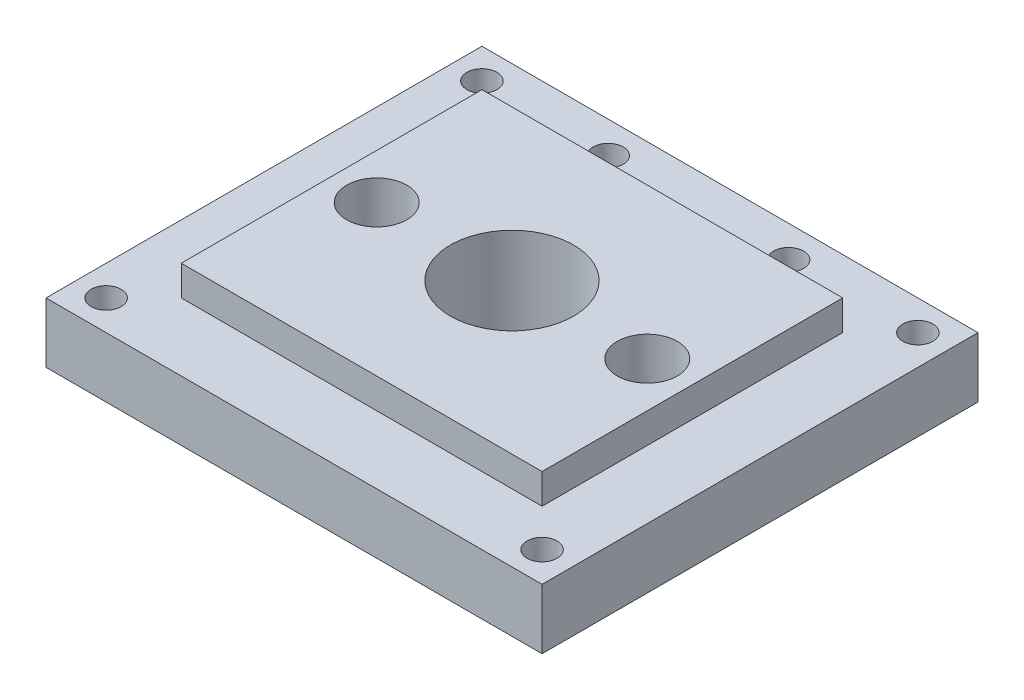
ISO-10303-21;
HEADER;
FILE_DESCRIPTION(('STEP AP214'),'2;1');
FILE_NAME('part.step','',(''),(''),'','','');
FILE_SCHEMA(('AUTOMOTIVE_DESIGN { 1 0 10303 214 1 1 1 1 }'));
ENDSEC;
DATA;
#1=APPLICATION_CONTEXT('core data for automotive mechanical design processes');
#2=APPLICATION_PROTOCOL_DEFINITION('international standard','automotive_design',2000,#1);
#3=PRODUCT_CONTEXT('',#1,'mechanical');
#4=PRODUCT('Part','Part','',(#3));
#5=PRODUCT_RELATED_PRODUCT_CATEGORY('part','',(#4));
#6=PRODUCT_DEFINITION_FORMATION('','',#4);
#7=PRODUCT_DEFINITION_CONTEXT('part definition',#1,'design');
#8=PRODUCT_DEFINITION('design','',#6,#7);
#9=PRODUCT_DEFINITION_SHAPE('','',#8);
#10=(LENGTH_UNIT() NAMED_UNIT(*) SI_UNIT(.MILLI.,.METRE.));
#11=(NAMED_UNIT(*) PLANE_ANGLE_UNIT() SI_UNIT($,.RADIAN.));
#12=(NAMED_UNIT(*) SI_UNIT($,.STERADIAN.) SOLID_ANGLE_UNIT());
#13=UNCERTAINTY_MEASURE_WITH_UNIT(LENGTH_MEASURE(1.E-05),#10,'distance_accuracy_value','');
#14=(GEOMETRIC_REPRESENTATION_CONTEXT(3) GLOBAL_UNCERTAINTY_ASSIGNED_CONTEXT((#13)) GLOBAL_UNIT_ASSIGNED_CONTEXT((#10,
#11,#12)) REPRESENTATION_CONTEXT('',''));
#15=CARTESIAN_POINT('',(0.,0.,0.));
#16=DIRECTION('',(0.,0.,1.));
#17=DIRECTION('',(1.,0.,0.));
#18=AXIS2_PLACEMENT_3D('',#15,#16,#17);
#19=CARTESIAN_POINT('',(-4.5,0.,0.));
#20=DIRECTION('',(0.,1.,0.));
#21=DIRECTION('',(0.,0.,1.));
#22=AXIS2_PLACEMENT_3D('',#19,#20,#21);
#23=CYLINDRICAL_SURFACE('',#22,1.);
#24=CARTESIAN_POINT('',(-4.5,3.,0.));
#25=DIRECTION('',(0.,1.,0.));
#26=DIRECTION('',(0.,0.,1.));
#27=AXIS2_PLACEMENT_3D('',#24,#25,#26);
#28=CIRCLE('',#27,1.);
#29=CARTESIAN_POINT('',(-4.5,3.,1.));
#30=VERTEX_POINT('',#29);
#31=EDGE_CURVE('E592',#30,#30,#28,.T.);
#32=ORIENTED_EDGE('',*,*,#31,.T.);
#33=EDGE_LOOP('',(#32));
#34=FACE_BOUND('',#33,.T.);
#35=CARTESIAN_POINT('',(-4.5,1.,0.));
#36=DIRECTION('',(0.,-1.,0.));
#37=DIRECTION('',(0.,0.,-1.));
#38=AXIS2_PLACEMENT_3D('',#35,#36,#37);
#39=CIRCLE('',#38,1.);
#40=CARTESIAN_POINT('',(-4.5,1.,-1.));
#41=VERTEX_POINT('',#40);
#42=EDGE_CURVE('E199',#41,#41,#39,.F.);
#43=ORIENTED_EDGE('',*,*,#42,.F.);
#44=EDGE_LOOP('',(#43));
#45=FACE_BOUND('',#44,.T.);
#46=ADVANCED_FACE('F40',(#34,#45),#23,.F.);
#47=CARTESIAN_POINT('',(4.5,0.,0.));
#48=DIRECTION('',(0.,1.,0.));
#49=DIRECTION('',(0.,0.,1.));
#50=AXIS2_PLACEMENT_3D('',#47,#48,#49);
#51=CYLINDRICAL_SURFACE('',#50,1.);
#52=CARTESIAN_POINT('',(4.5,3.,0.));
#53=DIRECTION('',(0.,1.,0.));
#54=DIRECTION('',(0.,0.,-1.));
#55=AXIS2_PLACEMENT_3D('',#52,#53,#54);
#56=CIRCLE('',#55,1.);
#57=CARTESIAN_POINT('',(4.5,3.,-1.));
#58=VERTEX_POINT('',#57);
#59=EDGE_CURVE('E194',#58,#58,#56,.T.);
#60=ORIENTED_EDGE('',*,*,#59,.T.);
#61=EDGE_LOOP('',(#60));
#62=FACE_BOUND('',#61,.T.);
#63=CARTESIAN_POINT('',(4.5,1.,0.));
#64=DIRECTION('',(0.,-1.,0.));
#65=DIRECTION('',(0.,0.,-1.));
#66=AXIS2_PLACEMENT_3D('',#63,#64,#65);
#67=CIRCLE('',#66,1.);
#68=CARTESIAN_POINT('',(4.5,1.,-1.));
#69=VERTEX_POINT('',#68);
#70=EDGE_CURVE('E195',#69,#69,#67,.F.);
#71=ORIENTED_EDGE('',*,*,#70,.F.);
#72=EDGE_LOOP('',(#71));
#73=FACE_BOUND('',#72,.T.);
#74=ADVANCED_FACE('F217',(#62,#73),#51,.F.);
#75=CARTESIAN_POINT('',(-7.25,0.,-6.25));
#76=DIRECTION('',(0.,1.,0.));
#77=DIRECTION('',(0.,0.,1.));
#78=AXIS2_PLACEMENT_3D('',#75,#76,#77);
#79=CYLINDRICAL_SURFACE('',#78,0.500000000000002);
#80=CARTESIAN_POINT('',(-7.25,2.,-6.25));
#81=DIRECTION('',(0.,1.,0.));
#82=DIRECTION('',(0.,0.,1.));
#83=AXIS2_PLACEMENT_3D('',#80,#81,#82);
#84=CIRCLE('',#83,0.500000000000002);
#85=CARTESIAN_POINT('',(-7.25,2.,-5.75));
#86=VERTEX_POINT('',#85);
#87=EDGE_CURVE('E611',#86,#86,#84,.T.);
#88=ORIENTED_EDGE('',*,*,#87,.T.);
#89=EDGE_LOOP('',(#88));
#90=FACE_BOUND('',#89,.T.);
#91=CARTESIAN_POINT('',(-7.25,1.,-6.25));
#92=DIRECTION('',(0.,-1.,0.));
#93=DIRECTION('',(0.,0.,-1.));
#94=AXIS2_PLACEMENT_3D('',#91,#92,#93);
#95=CIRCLE('',#94,0.500000000000002);
#96=CARTESIAN_POINT('',(-7.25,1.,-6.75));
#97=VERTEX_POINT('',#96);
#98=EDGE_CURVE('E190',#97,#97,#95,.F.);
#99=ORIENTED_EDGE('',*,*,#98,.F.);
#100=EDGE_LOOP('',(#99));
#101=FACE_BOUND('',#100,.T.);
#102=ADVANCED_FACE('F219',(#90,#101),#79,.F.);
#103=CARTESIAN_POINT('',(7.25,0.,-6.25));
#104=DIRECTION('',(0.,1.,0.));
#105=DIRECTION('',(0.,0.,1.));
#106=AXIS2_PLACEMENT_3D('',#103,#104,#105);
#107=CYLINDRICAL_SURFACE('',#106,0.500000000000002);
#108=CARTESIAN_POINT('',(7.25,2.,-6.25));
#109=DIRECTION('',(0.,1.,0.));
#110=DIRECTION('',(0.,0.,-1.));
#111=AXIS2_PLACEMENT_3D('',#108,#109,#110);
#112=CIRCLE('',#111,0.500000000000002);
#113=CARTESIAN_POINT('',(7.25,2.,-6.75));
#114=VERTEX_POINT('',#113);
#115=EDGE_CURVE('E607',#114,#114,#112,.T.);
#116=ORIENTED_EDGE('',*,*,#115,.T.);
#117=EDGE_LOOP('',(#116));
#118=FACE_BOUND('',#117,.T.);
#119=CARTESIAN_POINT('',(7.25,1.,-6.25));
#120=DIRECTION('',(0.,-1.,0.));
#121=DIRECTION('',(0.,0.,-1.));
#122=AXIS2_PLACEMENT_3D('',#119,#120,#121);
#123=CIRCLE('',#122,0.500000000000002);
#124=CARTESIAN_POINT('',(7.25,1.,-6.75));
#125=VERTEX_POINT('',#124);
#126=EDGE_CURVE('E186',#125,#125,#123,.F.);
#127=ORIENTED_EDGE('',*,*,#126,.F.);
#128=EDGE_LOOP('',(#127));
#129=FACE_BOUND('',#128,.T.);
#130=ADVANCED_FACE('F226',(#118,#129),#107,.F.);
#131=CARTESIAN_POINT('',(7.25,0.,6.25));
#132=DIRECTION('',(0.,1.,0.));
#133=DIRECTION('',(0.,0.,1.));
#134=AXIS2_PLACEMENT_3D('',#131,#132,#133);
#135=CYLINDRICAL_SURFACE('',#134,0.500000000000002);
#136=CARTESIAN_POINT('',(7.25,2.,6.25));
#137=DIRECTION('',(0.,1.,0.));
#138=DIRECTION('',(0.,0.,1.));
#139=AXIS2_PLACEMENT_3D('',#136,#137,#138);
#140=CIRCLE('',#139,0.500000000000002);
#141=CARTESIAN_POINT('',(7.25,2.,6.75));
#142=VERTEX_POINT('',#141);
#143=EDGE_CURVE('E612',#142,#142,#140,.T.);
#144=ORIENTED_EDGE('',*,*,#143,.T.);
#145=EDGE_LOOP('',(#144));
#146=FACE_BOUND('',#145,.T.);
#147=CARTESIAN_POINT('',(7.25,1.,6.25));
#148=DIRECTION('',(0.,-1.,0.));
#149=DIRECTION('',(0.,0.,-1.));
#150=AXIS2_PLACEMENT_3D('',#147,#148,#149);
#151=CIRCLE('',#150,0.500000000000002);
#152=CARTESIAN_POINT('',(7.25,1.,5.75));
#153=VERTEX_POINT('',#152);
#154=EDGE_CURVE('E181',#153,#153,#151,.F.);
#155=ORIENTED_EDGE('',*,*,#154,.F.);
#156=EDGE_LOOP('',(#155));
#157=FACE_BOUND('',#156,.T.);
#158=ADVANCED_FACE('F241',(#146,#157),#135,.F.);
#159=CARTESIAN_POINT('',(-7.25,0.,6.25));
#160=DIRECTION('',(0.,1.,0.));
#161=DIRECTION('',(0.,0.,1.));
#162=AXIS2_PLACEMENT_3D('',#159,#160,#161);
#163=CYLINDRICAL_SURFACE('',#162,0.500000000000002);
#164=CARTESIAN_POINT('',(-7.25,2.,6.25));
#165=DIRECTION('',(0.,1.,0.));
#166=DIRECTION('',(0.,0.,-1.));
#167=AXIS2_PLACEMENT_3D('',#164,#165,#166);
#168=CIRCLE('',#167,0.500000000000002);
#169=CARTESIAN_POINT('',(-7.25,2.,5.75));
#170=VERTEX_POINT('',#169);
#171=EDGE_CURVE('E603',#170,#170,#168,.T.);
#172=ORIENTED_EDGE('',*,*,#171,.T.);
#173=EDGE_LOOP('',(#172));
#174=FACE_BOUND('',#173,.T.);
#175=CARTESIAN_POINT('',(-7.25,1.,6.25));
#176=DIRECTION('',(0.,-1.,0.));
#177=DIRECTION('',(0.,0.,-1.));
#178=AXIS2_PLACEMENT_3D('',#175,#176,#177);
#179=CIRCLE('',#178,0.500000000000002);
#180=CARTESIAN_POINT('',(-7.25,1.,5.75));
#181=VERTEX_POINT('',#180);
#182=EDGE_CURVE('E177',#181,#181,#179,.F.);
#183=ORIENTED_EDGE('',*,*,#182,.F.);
#184=EDGE_LOOP('',(#183));
#185=FACE_BOUND('',#184,.T.);
#186=ADVANCED_FACE('F245',(#174,#185),#163,.F.);
#187=CARTESIAN_POINT('',(-8.25,2.,7.25));
#188=DIRECTION('',(1.,0.,0.));
#189=DIRECTION('',(0.,0.,-1.));
#190=AXIS2_PLACEMENT_3D('',#187,#188,#189);
#191=PLANE('',#190);
#192=DIRECTION('',(0.,0.,1.));
#193=VECTOR('',#192,1.);
#194=CARTESIAN_POINT('',(-8.25,0.,7.25));
#195=LINE('',#194,#193);
#196=CARTESIAN_POINT('',(-8.25,0.,-7.25));
#197=VERTEX_POINT('',#196);
#198=CARTESIAN_POINT('',(-8.25,0.,7.25));
#199=VERTEX_POINT('',#198);
#200=EDGE_CURVE('E129',#197,#199,#195,.T.);
#201=ORIENTED_EDGE('',*,*,#200,.T.);
#202=DIRECTION('',(0.,-1.,0.));
#203=VECTOR('',#202,1.);
#204=CARTESIAN_POINT('',(-8.25,2.,7.25));
#205=LINE('',#204,#203);
#206=CARTESIAN_POINT('',(-8.25,2.,7.25));
#207=VERTEX_POINT('',#206);
#208=EDGE_CURVE('E173',#207,#199,#205,.T.);
#209=ORIENTED_EDGE('',*,*,#208,.F.);
#210=DIRECTION('',(0.,0.,1.));
#211=VECTOR('',#210,1.);
#212=CARTESIAN_POINT('',(-8.25,2.,7.25));
#213=LINE('',#212,#211);
#214=CARTESIAN_POINT('',(-8.25,2.,-7.25));
#215=VERTEX_POINT('',#214);
#216=EDGE_CURVE('E140',#215,#207,#213,.T.);
#217=ORIENTED_EDGE('',*,*,#216,.F.);
#218=DIRECTION('',(0.,-1.,0.));
#219=VECTOR('',#218,1.);
#220=CARTESIAN_POINT('',(-8.25,2.,-7.25));
#221=LINE('',#220,#219);
#222=EDGE_CURVE('E153',#215,#197,#221,.T.);
#223=ORIENTED_EDGE('',*,*,#222,.T.);
#224=EDGE_LOOP('',(#201,#209,#217,#223));
#225=FACE_BOUND('',#224,.T.);
#226=ADVANCED_FACE('F248',(#225),#191,.F.);
#227=CARTESIAN_POINT('',(8.25,2.,7.25));
#228=DIRECTION('',(0.,0.,-1.));
#229=DIRECTION('',(-1.,0.,0.));
#230=AXIS2_PLACEMENT_3D('',#227,#228,#229);
#231=PLANE('',#230);
#232=DIRECTION('',(1.,0.,0.));
#233=VECTOR('',#232,1.);
#234=CARTESIAN_POINT('',(8.25,0.,7.25));
#235=LINE('',#234,#233);
#236=CARTESIAN_POINT('',(8.25,0.,7.25));
#237=VERTEX_POINT('',#236);
#238=EDGE_CURVE('E134',#199,#237,#235,.T.);
#239=ORIENTED_EDGE('',*,*,#238,.T.);
#240=DIRECTION('',(0.,-1.,0.));
#241=VECTOR('',#240,1.);
#242=CARTESIAN_POINT('',(8.25,2.,7.25));
#243=LINE('',#242,#241);
#244=CARTESIAN_POINT('',(8.25,2.,7.25));
#245=VERTEX_POINT('',#244);
#246=EDGE_CURVE('E169',#245,#237,#243,.T.);
#247=ORIENTED_EDGE('',*,*,#246,.F.);
#248=DIRECTION('',(1.,0.,0.));
#249=VECTOR('',#248,1.);
#250=CARTESIAN_POINT('',(8.25,2.,7.25));
#251=LINE('',#250,#249);
#252=EDGE_CURVE('E144',#207,#245,#251,.T.);
#253=ORIENTED_EDGE('',*,*,#252,.F.);
#254=ORIENTED_EDGE('',*,*,#208,.T.);
#255=EDGE_LOOP('',(#239,#247,#253,#254));
#256=FACE_BOUND('',#255,.T.);
#257=ADVANCED_FACE('F281',(#256),#231,.F.);
#258=CARTESIAN_POINT('',(8.25,2.,7.25));
#259=DIRECTION('',(-1.,0.,0.));
#260=DIRECTION('',(0.,0.,1.));
#261=AXIS2_PLACEMENT_3D('',#258,#259,#260);
#262=PLANE('',#261);
#263=DIRECTION('',(0.,0.,-1.));
#264=VECTOR('',#263,1.);
#265=CARTESIAN_POINT('',(8.25,0.,7.25));
#266=LINE('',#265,#264);
#267=CARTESIAN_POINT('',(8.25,0.,-7.25));
#268=VERTEX_POINT('',#267);
#269=EDGE_CURVE('E157',#237,#268,#266,.T.);
#270=ORIENTED_EDGE('',*,*,#269,.T.);
#271=DIRECTION('',(0.,-1.,0.));
#272=VECTOR('',#271,1.);
#273=CARTESIAN_POINT('',(8.25,2.,-7.25));
#274=LINE('',#273,#272);
#275=CARTESIAN_POINT('',(8.25,2.,-7.25));
#276=VERTEX_POINT('',#275);
#277=EDGE_CURVE('E165',#276,#268,#274,.T.);
#278=ORIENTED_EDGE('',*,*,#277,.F.);
#279=DIRECTION('',(0.,0.,-1.));
#280=VECTOR('',#279,1.);
#281=CARTESIAN_POINT('',(8.25,2.,7.25));
#282=LINE('',#281,#280);
#283=EDGE_CURVE('E148',#245,#276,#282,.T.);
#284=ORIENTED_EDGE('',*,*,#283,.F.);
#285=ORIENTED_EDGE('',*,*,#246,.T.);
#286=EDGE_LOOP('',(#270,#278,#284,#285));
#287=FACE_BOUND('',#286,.T.);
#288=ADVANCED_FACE('F277',(#287),#262,.F.);
#289=CARTESIAN_POINT('',(8.25,2.,-7.25));
#290=DIRECTION('',(0.,0.,1.));
#291=DIRECTION('',(1.,0.,0.));
#292=AXIS2_PLACEMENT_3D('',#289,#290,#291);
#293=PLANE('',#292);
#294=DIRECTION('',(-1.,0.,0.));
#295=VECTOR('',#294,1.);
#296=CARTESIAN_POINT('',(8.25,0.,-7.25));
#297=LINE('',#296,#295);
#298=EDGE_CURVE('E145',#268,#197,#297,.T.);
#299=ORIENTED_EDGE('',*,*,#298,.T.);
#300=ORIENTED_EDGE('',*,*,#222,.F.);
#301=DIRECTION('',(-1.,0.,0.));
#302=VECTOR('',#301,1.);
#303=CARTESIAN_POINT('',(8.25,2.,-7.25));
#304=LINE('',#303,#302);
#305=EDGE_CURVE('E151',#276,#215,#304,.T.);
#306=ORIENTED_EDGE('',*,*,#305,.F.);
#307=ORIENTED_EDGE('',*,*,#277,.T.);
#308=EDGE_LOOP('',(#299,#300,#306,#307));
#309=FACE_BOUND('',#308,.T.);
#310=ADVANCED_FACE('F270',(#309),#293,.F.);
#311=CARTESIAN_POINT('',(0.,2.,0.));
#312=DIRECTION('',(0.,1.,0.));
#313=DIRECTION('',(0.,0.,1.));
#314=AXIS2_PLACEMENT_3D('',#311,#312,#313);
#315=PLANE('',#314);
#316=CARTESIAN_POINT('',(-3.,2.,-6.2));
#317=DIRECTION('',(0.,1.,0.));
#318=DIRECTION('',(0.,0.,1.));
#319=AXIS2_PLACEMENT_3D('',#316,#317,#318);
#320=CIRCLE('',#319,0.5);
#321=CARTESIAN_POINT('',(-3.,2.,-5.7));
#322=VERTEX_POINT('',#321);
#323=EDGE_CURVE('E541',#322,#322,#320,.T.);
#324=ORIENTED_EDGE('',*,*,#323,.F.);
#325=EDGE_LOOP('',(#324));
#326=FACE_BOUND('',#325,.T.);
#327=CARTESIAN_POINT('',(3.,2.,-6.2));
#328=DIRECTION('',(0.,1.,0.));
#329=DIRECTION('',(0.,0.,-1.));
#330=AXIS2_PLACEMENT_3D('',#327,#328,#329);
#331=CIRCLE('',#330,0.499999999999999);
#332=CARTESIAN_POINT('',(3.,2.,-6.7));
#333=VERTEX_POINT('',#332);
#334=EDGE_CURVE('E550',#333,#333,#331,.T.);
#335=ORIENTED_EDGE('',*,*,#334,.F.);
#336=EDGE_LOOP('',(#335));
#337=FACE_BOUND('',#336,.T.);
#338=ORIENTED_EDGE('',*,*,#171,.F.);
#339=EDGE_LOOP('',(#338));
#340=FACE_BOUND('',#339,.T.);
#341=ORIENTED_EDGE('',*,*,#143,.F.);
#342=EDGE_LOOP('',(#341));
#343=FACE_BOUND('',#342,.T.);
#344=ORIENTED_EDGE('',*,*,#115,.F.);
#345=EDGE_LOOP('',(#344));
#346=FACE_BOUND('',#345,.T.);
#347=ORIENTED_EDGE('',*,*,#87,.F.);
#348=EDGE_LOOP('',(#347));
#349=FACE_BOUND('',#348,.T.);
#350=DIRECTION('',(0.,0.,1.));
#351=VECTOR('',#350,1.);
#352=CARTESIAN_POINT('',(-6.,2.,5.));
#353=LINE('',#352,#351);
#354=CARTESIAN_POINT('',(-6.,2.,-5.));
#355=VERTEX_POINT('',#354);
#356=CARTESIAN_POINT('',(-6.,2.,5.));
#357=VERTEX_POINT('',#356);
#358=EDGE_CURVE('E56',#355,#357,#353,.T.);
#359=ORIENTED_EDGE('',*,*,#358,.F.);
#360=DIRECTION('',(-1.,0.,0.));
#361=VECTOR('',#360,1.);
#362=CARTESIAN_POINT('',(6.,2.,-5.));
#363=LINE('',#362,#361);
#364=CARTESIAN_POINT('',(6.,2.,-5.));
#365=VERTEX_POINT('',#364);
#366=EDGE_CURVE('E60',#365,#355,#363,.T.);
#367=ORIENTED_EDGE('',*,*,#366,.F.);
#368=DIRECTION('',(0.,0.,-1.));
#369=VECTOR('',#368,1.);
#370=CARTESIAN_POINT('',(6.,2.,5.));
#371=LINE('',#370,#369);
#372=CARTESIAN_POINT('',(6.,2.,5.));
#373=VERTEX_POINT('',#372);
#374=EDGE_CURVE('E632',#373,#365,#371,.T.);
#375=ORIENTED_EDGE('',*,*,#374,.F.);
#376=DIRECTION('',(1.,0.,0.));
#377=VECTOR('',#376,1.);
#378=CARTESIAN_POINT('',(6.,2.,5.));
#379=LINE('',#378,#377);
#380=EDGE_CURVE('E629',#357,#373,#379,.T.);
#381=ORIENTED_EDGE('',*,*,#380,.F.);
#382=EDGE_LOOP('',(#359,#367,#375,#381));
#383=FACE_BOUND('',#382,.T.);
#384=ORIENTED_EDGE('',*,*,#216,.T.);
#385=ORIENTED_EDGE('',*,*,#252,.T.);
#386=ORIENTED_EDGE('',*,*,#283,.T.);
#387=ORIENTED_EDGE('',*,*,#305,.T.);
#388=EDGE_LOOP('',(#384,#385,#386,#387));
#389=FACE_BOUND('',#388,.T.);
#390=ADVANCED_FACE('F267',(#326,#337,#340,#343,#346,#349,#383,#389),#315,.T.);
#391=CARTESIAN_POINT('',(0.,0.,0.));
#392=DIRECTION('',(0.,1.,0.));
#393=DIRECTION('',(0.,0.,1.));
#394=AXIS2_PLACEMENT_3D('',#391,#392,#393);
#395=PLANE('',#394);
#396=CARTESIAN_POINT('',(-3.,0.,-6.2));
#397=DIRECTION('',(0.,1.,0.));
#398=DIRECTION('',(0.,0.,1.));
#399=AXIS2_PLACEMENT_3D('',#396,#397,#398);
#400=CIRCLE('',#399,0.5);
#401=CARTESIAN_POINT('',(-3.,0.,-5.7));
#402=VERTEX_POINT('',#401);
#403=EDGE_CURVE('E538',#402,#402,#400,.T.);
#404=ORIENTED_EDGE('',*,*,#403,.T.);
#405=EDGE_LOOP('',(#404));
#406=FACE_BOUND('',#405,.T.);
#407=CARTESIAN_POINT('',(3.,0.,-6.2));
#408=DIRECTION('',(0.,1.,0.));
#409=DIRECTION('',(0.,0.,-1.));
#410=AXIS2_PLACEMENT_3D('',#407,#408,#409);
#411=CIRCLE('',#410,0.499999999999999);
#412=CARTESIAN_POINT('',(3.,0.,-6.7));
#413=VERTEX_POINT('',#412);
#414=EDGE_CURVE('E543',#413,#413,#411,.T.);
#415=ORIENTED_EDGE('',*,*,#414,.T.);
#416=EDGE_LOOP('',(#415));
#417=FACE_BOUND('',#416,.T.);
#418=CARTESIAN_POINT('',(-4.5,0.,0.));
#419=DIRECTION('',(0.,-1.,0.));
#420=DIRECTION('',(0.,0.,-1.));
#421=AXIS2_PLACEMENT_3D('',#418,#419,#420);
#422=CIRCLE('',#421,1.5);
#423=CARTESIAN_POINT('',(-4.5,0.,-1.5));
#424=VERTEX_POINT('',#423);
#425=EDGE_CURVE('E200',#424,#424,#422,.T.);
#426=ORIENTED_EDGE('',*,*,#425,.F.);
#427=EDGE_LOOP('',(#426));
#428=FACE_BOUND('',#427,.T.);
#429=CARTESIAN_POINT('',(4.5,0.,0.));
#430=DIRECTION('',(0.,-1.,0.));
#431=DIRECTION('',(0.,0.,-1.));
#432=AXIS2_PLACEMENT_3D('',#429,#430,#431);
#433=CIRCLE('',#432,1.5);
#434=CARTESIAN_POINT('',(4.5,0.,-1.5));
#435=VERTEX_POINT('',#434);
#436=EDGE_CURVE('E547',#435,#435,#433,.T.);
#437=ORIENTED_EDGE('',*,*,#436,.F.);
#438=EDGE_LOOP('',(#437));
#439=FACE_BOUND('',#438,.T.);
#440=CARTESIAN_POINT('',(-7.25,0.,-6.25));
#441=DIRECTION('',(0.,-1.,0.));
#442=DIRECTION('',(0.,0.,-1.));
#443=AXIS2_PLACEMENT_3D('',#440,#441,#442);
#444=CIRCLE('',#443,0.749999999999999);
#445=CARTESIAN_POINT('',(-7.25,0.,-7.));
#446=VERTEX_POINT('',#445);
#447=EDGE_CURVE('E575',#446,#446,#444,.T.);
#448=ORIENTED_EDGE('',*,*,#447,.F.);
#449=EDGE_LOOP('',(#448));
#450=FACE_BOUND('',#449,.T.);
#451=CARTESIAN_POINT('',(7.25,0.,6.25));
#452=DIRECTION('',(0.,-1.,0.));
#453=DIRECTION('',(0.,0.,-1.));
#454=AXIS2_PLACEMENT_3D('',#451,#452,#453);
#455=CIRCLE('',#454,0.749999999999999);
#456=CARTESIAN_POINT('',(7.25,0.,5.5));
#457=VERTEX_POINT('',#456);
#458=EDGE_CURVE('E566',#457,#457,#455,.T.);
#459=ORIENTED_EDGE('',*,*,#458,.F.);
#460=EDGE_LOOP('',(#459));
#461=FACE_BOUND('',#460,.T.);
#462=CARTESIAN_POINT('',(-7.25,0.,6.25));
#463=DIRECTION('',(0.,-1.,0.));
#464=DIRECTION('',(0.,0.,-1.));
#465=AXIS2_PLACEMENT_3D('',#462,#463,#464);
#466=CIRCLE('',#465,0.749999999999999);
#467=CARTESIAN_POINT('',(-7.25,0.,5.5));
#468=VERTEX_POINT('',#467);
#469=EDGE_CURVE('E203',#468,#468,#466,.T.);
#470=ORIENTED_EDGE('',*,*,#469,.F.);
#471=EDGE_LOOP('',(#470));
#472=FACE_BOUND('',#471,.T.);
#473=CARTESIAN_POINT('',(7.25,0.,-6.25));
#474=DIRECTION('',(0.,-1.,0.));
#475=DIRECTION('',(0.,0.,-1.));
#476=AXIS2_PLACEMENT_3D('',#473,#474,#475);
#477=CIRCLE('',#476,0.749999999999999);
#478=CARTESIAN_POINT('',(7.25,0.,-7.));
#479=VERTEX_POINT('',#478);
#480=EDGE_CURVE('E574',#479,#479,#477,.T.);
#481=ORIENTED_EDGE('',*,*,#480,.F.);
#482=EDGE_LOOP('',(#481));
#483=FACE_BOUND('',#482,.T.);
#484=CARTESIAN_POINT('',(0.,0.,0.));
#485=DIRECTION('',(0.,1.,0.));
#486=DIRECTION('',(0.,0.,1.));
#487=AXIS2_PLACEMENT_3D('',#484,#485,#486);
#488=CIRCLE('',#487,2.05);
#489=CARTESIAN_POINT('',(0.,0.,2.05));
#490=VERTEX_POINT('',#489);
#491=EDGE_CURVE('E599',#490,#490,#488,.T.);
#492=ORIENTED_EDGE('',*,*,#491,.T.);
#493=EDGE_LOOP('',(#492));
#494=FACE_BOUND('',#493,.T.);
#495=ORIENTED_EDGE('',*,*,#200,.F.);
#496=ORIENTED_EDGE('',*,*,#298,.F.);
#497=ORIENTED_EDGE('',*,*,#269,.F.);
#498=ORIENTED_EDGE('',*,*,#238,.F.);
#499=EDGE_LOOP('',(#495,#496,#497,#498));
#500=FACE_BOUND('',#499,.T.);
#501=ADVANCED_FACE('F266',(#406,#417,#428,#439,#450,#461,#472,#483,#494,#500),#395,.F.);
#502=CARTESIAN_POINT('',(-6.,3.,5.));
#503=DIRECTION('',(1.,0.,0.));
#504=DIRECTION('',(0.,0.,-1.));
#505=AXIS2_PLACEMENT_3D('',#502,#503,#504);
#506=PLANE('',#505);
#507=ORIENTED_EDGE('',*,*,#358,.T.);
#508=DIRECTION('',(0.,-1.,0.));
#509=VECTOR('',#508,1.);
#510=CARTESIAN_POINT('',(-6.,3.,5.));
#511=LINE('',#510,#509);
#512=CARTESIAN_POINT('',(-6.,3.,5.));
#513=VERTEX_POINT('',#512);
#514=EDGE_CURVE('E109',#513,#357,#511,.T.);
#515=ORIENTED_EDGE('',*,*,#514,.F.);
#516=DIRECTION('',(0.,0.,1.));
#517=VECTOR('',#516,1.);
#518=CARTESIAN_POINT('',(-6.,3.,5.));
#519=LINE('',#518,#517);
#520=CARTESIAN_POINT('',(-6.,3.,-5.));
#521=VERTEX_POINT('',#520);
#522=EDGE_CURVE('E116',#521,#513,#519,.T.);
#523=ORIENTED_EDGE('',*,*,#522,.F.);
#524=DIRECTION('',(0.,-1.,0.));
#525=VECTOR('',#524,1.);
#526=CARTESIAN_POINT('',(-6.,3.,-5.));
#527=LINE('',#526,#525);
#528=EDGE_CURVE('E626',#521,#355,#527,.T.);
#529=ORIENTED_EDGE('',*,*,#528,.T.);
#530=EDGE_LOOP('',(#507,#515,#523,#529));
#531=FACE_BOUND('',#530,.T.);
#532=ADVANCED_FACE('F127',(#531),#506,.F.);
#533=CARTESIAN_POINT('',(6.,3.,5.));
#534=DIRECTION('',(0.,0.,-1.));
#535=DIRECTION('',(-1.,0.,0.));
#536=AXIS2_PLACEMENT_3D('',#533,#534,#535);
#537=PLANE('',#536);
#538=ORIENTED_EDGE('',*,*,#380,.T.);
#539=DIRECTION('',(0.,-1.,0.));
#540=VECTOR('',#539,1.);
#541=CARTESIAN_POINT('',(6.,3.,5.));
#542=LINE('',#541,#540);
#543=CARTESIAN_POINT('',(6.,3.,5.));
#544=VERTEX_POINT('',#543);
#545=EDGE_CURVE('E111',#544,#373,#542,.T.);
#546=ORIENTED_EDGE('',*,*,#545,.F.);
#547=DIRECTION('',(1.,0.,0.));
#548=VECTOR('',#547,1.);
#549=CARTESIAN_POINT('',(6.,3.,5.));
#550=LINE('',#549,#548);
#551=EDGE_CURVE('E104',#513,#544,#550,.T.);
#552=ORIENTED_EDGE('',*,*,#551,.F.);
#553=ORIENTED_EDGE('',*,*,#514,.T.);
#554=EDGE_LOOP('',(#538,#546,#552,#553));
#555=FACE_BOUND('',#554,.T.);
#556=ADVANCED_FACE('F107',(#555),#537,.F.);
#557=CARTESIAN_POINT('',(6.,3.,5.));
#558=DIRECTION('',(-1.,0.,0.));
#559=DIRECTION('',(0.,0.,1.));
#560=AXIS2_PLACEMENT_3D('',#557,#558,#559);
#561=PLANE('',#560);
#562=ORIENTED_EDGE('',*,*,#374,.T.);
#563=DIRECTION('',(0.,-1.,0.));
#564=VECTOR('',#563,1.);
#565=CARTESIAN_POINT('',(6.,3.,-5.));
#566=LINE('',#565,#564);
#567=CARTESIAN_POINT('',(6.,3.,-5.));
#568=VERTEX_POINT('',#567);
#569=EDGE_CURVE('E136',#568,#365,#566,.T.);
#570=ORIENTED_EDGE('',*,*,#569,.F.);
#571=DIRECTION('',(0.,0.,-1.));
#572=VECTOR('',#571,1.);
#573=CARTESIAN_POINT('',(6.,3.,5.));
#574=LINE('',#573,#572);
#575=EDGE_CURVE('E115',#544,#568,#574,.T.);
#576=ORIENTED_EDGE('',*,*,#575,.F.);
#577=ORIENTED_EDGE('',*,*,#545,.T.);
#578=EDGE_LOOP('',(#562,#570,#576,#577));
#579=FACE_BOUND('',#578,.T.);
#580=ADVANCED_FACE('F257',(#579),#561,.F.);
#581=CARTESIAN_POINT('',(6.,3.,-5.));
#582=DIRECTION('',(0.,0.,1.));
#583=DIRECTION('',(1.,0.,0.));
#584=AXIS2_PLACEMENT_3D('',#581,#582,#583);
#585=PLANE('',#584);
#586=ORIENTED_EDGE('',*,*,#366,.T.);
#587=ORIENTED_EDGE('',*,*,#528,.F.);
#588=DIRECTION('',(-1.,0.,0.));
#589=VECTOR('',#588,1.);
#590=CARTESIAN_POINT('',(6.,3.,-5.));
#591=LINE('',#590,#589);
#592=EDGE_CURVE('E121',#568,#521,#591,.T.);
#593=ORIENTED_EDGE('',*,*,#592,.F.);
#594=ORIENTED_EDGE('',*,*,#569,.T.);
#595=EDGE_LOOP('',(#586,#587,#593,#594));
#596=FACE_BOUND('',#595,.T.);
#597=ADVANCED_FACE('F253',(#596),#585,.F.);
#598=CARTESIAN_POINT('',(0.,3.,0.));
#599=DIRECTION('',(0.,1.,0.));
#600=DIRECTION('',(0.,0.,1.));
#601=AXIS2_PLACEMENT_3D('',#598,#599,#600);
#602=PLANE('',#601);
#603=ORIENTED_EDGE('',*,*,#59,.F.);
#604=EDGE_LOOP('',(#603));
#605=FACE_BOUND('',#604,.T.);
#606=ORIENTED_EDGE('',*,*,#31,.F.);
#607=EDGE_LOOP('',(#606));
#608=FACE_BOUND('',#607,.T.);
#609=CARTESIAN_POINT('',(0.,3.,0.));
#610=DIRECTION('',(0.,1.,0.));
#611=DIRECTION('',(0.,0.,1.));
#612=AXIS2_PLACEMENT_3D('',#609,#610,#611);
#613=CIRCLE('',#612,2.05);
#614=CARTESIAN_POINT('',(0.,3.,2.05));
#615=VERTEX_POINT('',#614);
#616=EDGE_CURVE('E596',#615,#615,#613,.T.);
#617=ORIENTED_EDGE('',*,*,#616,.F.);
#618=EDGE_LOOP('',(#617));
#619=FACE_BOUND('',#618,.T.);
#620=ORIENTED_EDGE('',*,*,#522,.T.);
#621=ORIENTED_EDGE('',*,*,#551,.T.);
#622=ORIENTED_EDGE('',*,*,#575,.T.);
#623=ORIENTED_EDGE('',*,*,#592,.T.);
#624=EDGE_LOOP('',(#620,#621,#622,#623));
#625=FACE_BOUND('',#624,.T.);
#626=ADVANCED_FACE('F119',(#605,#608,#619,#625),#602,.T.);
#627=CARTESIAN_POINT('',(0.,0.,0.));
#628=DIRECTION('',(0.,1.,0.));
#629=DIRECTION('',(0.,0.,1.));
#630=AXIS2_PLACEMENT_3D('',#627,#628,#629);
#631=CYLINDRICAL_SURFACE('',#630,2.05);
#632=ORIENTED_EDGE('',*,*,#491,.F.);
#633=EDGE_LOOP('',(#632));
#634=FACE_BOUND('',#633,.T.);
#635=ORIENTED_EDGE('',*,*,#616,.T.);
#636=EDGE_LOOP('',(#635));
#637=FACE_BOUND('',#636,.T.);
#638=ADVANCED_FACE('F234',(#634,#637),#631,.F.);
#639=CARTESIAN_POINT('',(-7.25,1.,6.25));
#640=DIRECTION('',(0.,-1.,0.));
#641=DIRECTION('',(0.,0.,-1.));
#642=AXIS2_PLACEMENT_3D('',#639,#640,#641);
#643=PLANE('',#642);
#644=CARTESIAN_POINT('',(-7.25,1.,6.25));
#645=DIRECTION('',(0.,-1.,0.));
#646=DIRECTION('',(0.,0.,-1.));
#647=AXIS2_PLACEMENT_3D('',#644,#645,#646);
#648=CIRCLE('',#647,0.749999999999999);
#649=CARTESIAN_POINT('',(-7.25,1.,5.5));
#650=VERTEX_POINT('',#649);
#651=EDGE_CURVE('E562',#650,#650,#648,.T.);
#652=ORIENTED_EDGE('',*,*,#651,.T.);
#653=EDGE_LOOP('',(#652));
#654=FACE_BOUND('',#653,.T.);
#655=ORIENTED_EDGE('',*,*,#182,.T.);
#656=EDGE_LOOP('',(#655));
#657=FACE_BOUND('',#656,.T.);
#658=ADVANCED_FACE('F237',(#654,#657),#643,.T.);
#659=CARTESIAN_POINT('',(-7.25,1.,6.25));
#660=DIRECTION('',(0.,-1.,0.));
#661=DIRECTION('',(0.,0.,-1.));
#662=AXIS2_PLACEMENT_3D('',#659,#660,#661);
#663=CYLINDRICAL_SURFACE('',#662,0.749999999999999);
#664=ORIENTED_EDGE('',*,*,#651,.F.);
#665=EDGE_LOOP('',(#664));
#666=FACE_BOUND('',#665,.T.);
#667=ORIENTED_EDGE('',*,*,#469,.T.);
#668=EDGE_LOOP('',(#667));
#669=FACE_BOUND('',#668,.T.);
#670=ADVANCED_FACE('F357',(#666,#669),#663,.F.);
#671=CARTESIAN_POINT('',(7.25,1.,6.25));
#672=DIRECTION('',(0.,-1.,0.));
#673=DIRECTION('',(0.,0.,-1.));
#674=AXIS2_PLACEMENT_3D('',#671,#672,#673);
#675=PLANE('',#674);
#676=CARTESIAN_POINT('',(7.25,1.,6.25));
#677=DIRECTION('',(0.,-1.,0.));
#678=DIRECTION('',(0.,0.,-1.));
#679=AXIS2_PLACEMENT_3D('',#676,#677,#678);
#680=CIRCLE('',#679,0.749999999999999);
#681=CARTESIAN_POINT('',(7.25,1.,5.5));
#682=VERTEX_POINT('',#681);
#683=EDGE_CURVE('E579',#682,#682,#680,.T.);
#684=ORIENTED_EDGE('',*,*,#683,.T.);
#685=EDGE_LOOP('',(#684));
#686=FACE_BOUND('',#685,.T.);
#687=ORIENTED_EDGE('',*,*,#154,.T.);
#688=EDGE_LOOP('',(#687));
#689=FACE_BOUND('',#688,.T.);
#690=ADVANCED_FACE('F365',(#686,#689),#675,.T.);
#691=CARTESIAN_POINT('',(7.25,1.,6.25));
#692=DIRECTION('',(0.,-1.,0.));
#693=DIRECTION('',(0.,0.,-1.));
#694=AXIS2_PLACEMENT_3D('',#691,#692,#693);
#695=CYLINDRICAL_SURFACE('',#694,0.749999999999999);
#696=ORIENTED_EDGE('',*,*,#683,.F.);
#697=EDGE_LOOP('',(#696));
#698=FACE_BOUND('',#697,.T.);
#699=ORIENTED_EDGE('',*,*,#458,.T.);
#700=EDGE_LOOP('',(#699));
#701=FACE_BOUND('',#700,.T.);
#702=ADVANCED_FACE('F373',(#698,#701),#695,.F.);
#703=CARTESIAN_POINT('',(7.25,1.,-6.25));
#704=DIRECTION('',(0.,-1.,0.));
#705=DIRECTION('',(0.,0.,-1.));
#706=AXIS2_PLACEMENT_3D('',#703,#704,#705);
#707=PLANE('',#706);
#708=CARTESIAN_POINT('',(7.25,1.,-6.25));
#709=DIRECTION('',(0.,-1.,0.));
#710=DIRECTION('',(0.,0.,-1.));
#711=AXIS2_PLACEMENT_3D('',#708,#709,#710);
#712=CIRCLE('',#711,0.749999999999999);
#713=CARTESIAN_POINT('',(7.25,1.,-7.));
#714=VERTEX_POINT('',#713);
#715=EDGE_CURVE('E182',#714,#714,#712,.T.);
#716=ORIENTED_EDGE('',*,*,#715,.T.);
#717=EDGE_LOOP('',(#716));
#718=FACE_BOUND('',#717,.T.);
#719=ORIENTED_EDGE('',*,*,#126,.T.);
#720=EDGE_LOOP('',(#719));
#721=FACE_BOUND('',#720,.T.);
#722=ADVANCED_FACE('F381',(#718,#721),#707,.T.);
#723=CARTESIAN_POINT('',(7.25,1.,-6.25));
#724=DIRECTION('',(0.,-1.,0.));
#725=DIRECTION('',(0.,0.,-1.));
#726=AXIS2_PLACEMENT_3D('',#723,#724,#725);
#727=CYLINDRICAL_SURFACE('',#726,0.749999999999999);
#728=ORIENTED_EDGE('',*,*,#715,.F.);
#729=EDGE_LOOP('',(#728));
#730=FACE_BOUND('',#729,.T.);
#731=ORIENTED_EDGE('',*,*,#480,.T.);
#732=EDGE_LOOP('',(#731));
#733=FACE_BOUND('',#732,.T.);
#734=ADVANCED_FACE('F389',(#730,#733),#727,.F.);
#735=CARTESIAN_POINT('',(-7.25,1.,-6.25));
#736=DIRECTION('',(0.,-1.,0.));
#737=DIRECTION('',(0.,0.,-1.));
#738=AXIS2_PLACEMENT_3D('',#735,#736,#737);
#739=PLANE('',#738);
#740=CARTESIAN_POINT('',(-7.25,1.,-6.25));
#741=DIRECTION('',(0.,-1.,0.));
#742=DIRECTION('',(0.,0.,-1.));
#743=AXIS2_PLACEMENT_3D('',#740,#741,#742);
#744=CIRCLE('',#743,0.749999999999999);
#745=CARTESIAN_POINT('',(-7.25,1.,-7.));
#746=VERTEX_POINT('',#745);
#747=EDGE_CURVE('E570',#746,#746,#744,.T.);
#748=ORIENTED_EDGE('',*,*,#747,.T.);
#749=EDGE_LOOP('',(#748));
#750=FACE_BOUND('',#749,.T.);
#751=ORIENTED_EDGE('',*,*,#98,.T.);
#752=EDGE_LOOP('',(#751));
#753=FACE_BOUND('',#752,.T.);
#754=ADVANCED_FACE('F397',(#750,#753),#739,.T.);
#755=CARTESIAN_POINT('',(-7.25,1.,-6.25));
#756=DIRECTION('',(0.,-1.,0.));
#757=DIRECTION('',(0.,0.,-1.));
#758=AXIS2_PLACEMENT_3D('',#755,#756,#757);
#759=CYLINDRICAL_SURFACE('',#758,0.749999999999999);
#760=ORIENTED_EDGE('',*,*,#747,.F.);
#761=EDGE_LOOP('',(#760));
#762=FACE_BOUND('',#761,.T.);
#763=ORIENTED_EDGE('',*,*,#447,.T.);
#764=EDGE_LOOP('',(#763));
#765=FACE_BOUND('',#764,.T.);
#766=ADVANCED_FACE('F404',(#762,#765),#759,.F.);
#767=CARTESIAN_POINT('',(4.5,1.,0.));
#768=DIRECTION('',(0.,-1.,0.));
#769=DIRECTION('',(0.,0.,-1.));
#770=AXIS2_PLACEMENT_3D('',#767,#768,#769);
#771=CYLINDRICAL_SURFACE('',#770,1.5);
#772=CARTESIAN_POINT('',(4.5,0.133974596215562,0.));
#773=DIRECTION('',(0.,1.,0.));
#774=DIRECTION('',(0.,0.,1.));
#775=AXIS2_PLACEMENT_3D('',#772,#773,#774);
#776=CIRCLE('',#775,1.5);
#777=CARTESIAN_POINT('',(4.5,0.133974596215562,1.5));
#778=VERTEX_POINT('',#777);
#779=EDGE_CURVE('E49',#778,#778,#776,.T.);
#780=ORIENTED_EDGE('',*,*,#779,.T.);
#781=EDGE_LOOP('',(#780));
#782=FACE_BOUND('',#781,.T.);
#783=ORIENTED_EDGE('',*,*,#436,.T.);
#784=EDGE_LOOP('',(#783));
#785=FACE_BOUND('',#784,.T.);
#786=ADVANCED_FACE('F208',(#782,#785),#771,.F.);
#787=CARTESIAN_POINT('',(-4.5,1.,0.));
#788=DIRECTION('',(0.,-1.,0.));
#789=DIRECTION('',(0.,0.,-1.));
#790=AXIS2_PLACEMENT_3D('',#787,#788,#789);
#791=CYLINDRICAL_SURFACE('',#790,1.5);
#792=CARTESIAN_POINT('',(-4.5,0.133974596215561,0.));
#793=DIRECTION('',(0.,1.,0.));
#794=DIRECTION('',(0.,0.,1.));
#795=AXIS2_PLACEMENT_3D('',#792,#793,#794);
#796=CIRCLE('',#795,1.5);
#797=CARTESIAN_POINT('',(-4.5,0.133974596215561,1.5));
#798=VERTEX_POINT('',#797);
#799=EDGE_CURVE('E11',#798,#798,#796,.T.);
#800=ORIENTED_EDGE('',*,*,#799,.T.);
#801=EDGE_LOOP('',(#800));
#802=FACE_BOUND('',#801,.T.);
#803=ORIENTED_EDGE('',*,*,#425,.T.);
#804=EDGE_LOOP('',(#803));
#805=FACE_BOUND('',#804,.T.);
#806=ADVANCED_FACE('F214',(#802,#805),#791,.F.);
#807=CARTESIAN_POINT('',(4.5,0.133974596215562,0.));
#808=DIRECTION('',(0.,1.,0.));
#809=DIRECTION('',(0.,0.,1.));
#810=AXIS2_PLACEMENT_3D('',#807,#808,#809);
#811=DEGENERATE_TOROIDAL_SURFACE('',#810,0.5,1.,.T.);
#812=ORIENTED_EDGE('',*,*,#779,.F.);
#813=EDGE_LOOP('',(#812));
#814=FACE_BOUND('',#813,.T.);
#815=ORIENTED_EDGE('',*,*,#70,.T.);
#816=EDGE_LOOP('',(#815));
#817=FACE_BOUND('',#816,.T.);
#818=ADVANCED_FACE('F211',(#814,#817),#811,.F.);
#819=CARTESIAN_POINT('',(-4.5,0.133974596215561,0.));
#820=DIRECTION('',(0.,1.,0.));
#821=DIRECTION('',(0.,0.,1.));
#822=AXIS2_PLACEMENT_3D('',#819,#820,#821);
#823=DEGENERATE_TOROIDAL_SURFACE('',#822,0.5,1.,.T.);
#824=ORIENTED_EDGE('',*,*,#799,.F.);
#825=EDGE_LOOP('',(#824));
#826=FACE_BOUND('',#825,.T.);
#827=ORIENTED_EDGE('',*,*,#42,.T.);
#828=EDGE_LOOP('',(#827));
#829=FACE_BOUND('',#828,.T.);
#830=ADVANCED_FACE('F42',(#826,#829),#823,.F.);
#831=CARTESIAN_POINT('',(3.,0.,-6.2));
#832=DIRECTION('',(0.,1.,0.));
#833=DIRECTION('',(0.,0.,1.));
#834=AXIS2_PLACEMENT_3D('',#831,#832,#833);
#835=CYLINDRICAL_SURFACE('',#834,0.499999999999999);
#836=ORIENTED_EDGE('',*,*,#414,.F.);
#837=EDGE_LOOP('',(#836));
#838=FACE_BOUND('',#837,.T.);
#839=ORIENTED_EDGE('',*,*,#334,.T.);
#840=EDGE_LOOP('',(#839));
#841=FACE_BOUND('',#840,.T.);
#842=ADVANCED_FACE('F436',(#838,#841),#835,.F.);
#843=CARTESIAN_POINT('',(-3.,0.,-6.2));
#844=DIRECTION('',(0.,1.,0.));
#845=DIRECTION('',(0.,0.,1.));
#846=AXIS2_PLACEMENT_3D('',#843,#844,#845);
#847=CYLINDRICAL_SURFACE('',#846,0.5);
#848=ORIENTED_EDGE('',*,*,#403,.F.);
#849=EDGE_LOOP('',(#848));
#850=FACE_BOUND('',#849,.T.);
#851=ORIENTED_EDGE('',*,*,#323,.T.);
#852=EDGE_LOOP('',(#851));
#853=FACE_BOUND('',#852,.T.);
#854=ADVANCED_FACE('F442',(#850,#853),#847,.F.);
#855=CLOSED_SHELL('',(#46,#74,#102,#130,#158,#186,#226,#257,#288,#310,#390,#501,#532,#556,#580,
#597,#626,#638,#658,#670,#690,#702,#722,#734,#754,#766,#786,#806,#818,#830,#842,#854));
#856=MANIFOLD_SOLID_BREP('B2',#855);
#857=ADVANCED_BREP_SHAPE_REPRESENTATION('',(#18,#856),#14);
#858=SHAPE_DEFINITION_REPRESENTATION(#9,#857);
ENDSEC;
END-ISO-10303-21;
